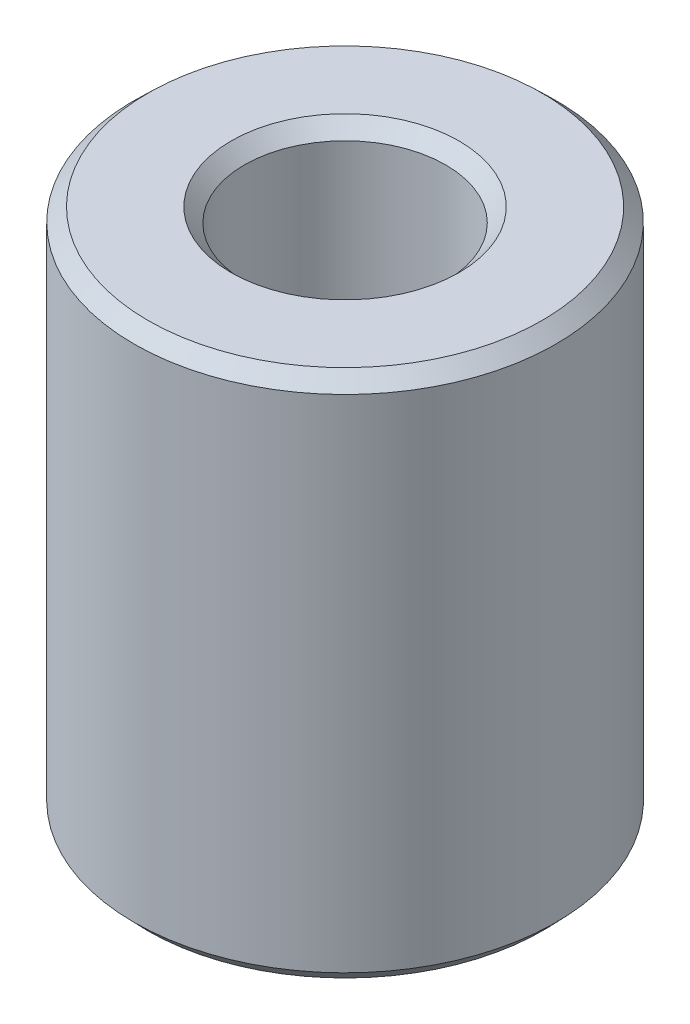
ISO-10303-21;
HEADER;
FILE_DESCRIPTION(('STEP AP214'),'2;1');
FILE_NAME('part.step','',(''),(''),'','','');
FILE_SCHEMA(('AUTOMOTIVE_DESIGN { 1 0 10303 214 1 1 1 1 }'));
ENDSEC;
DATA;
#1=APPLICATION_CONTEXT('core data for automotive mechanical design processes');
#2=APPLICATION_PROTOCOL_DEFINITION('international standard','automotive_design',2000,#1);
#3=PRODUCT_CONTEXT('',#1,'mechanical');
#4=PRODUCT('Part','Part','',(#3));
#5=PRODUCT_RELATED_PRODUCT_CATEGORY('part','',(#4));
#6=PRODUCT_DEFINITION_FORMATION('','',#4);
#7=PRODUCT_DEFINITION_CONTEXT('part definition',#1,'design');
#8=PRODUCT_DEFINITION('design','',#6,#7);
#9=PRODUCT_DEFINITION_SHAPE('','',#8);
#10=(LENGTH_UNIT() NAMED_UNIT(*) SI_UNIT(.MILLI.,.METRE.));
#11=(NAMED_UNIT(*) PLANE_ANGLE_UNIT() SI_UNIT($,.RADIAN.));
#12=(NAMED_UNIT(*) SI_UNIT($,.STERADIAN.) SOLID_ANGLE_UNIT());
#13=UNCERTAINTY_MEASURE_WITH_UNIT(LENGTH_MEASURE(1.E-05),#10,'distance_accuracy_value','');
#14=(GEOMETRIC_REPRESENTATION_CONTEXT(3) GLOBAL_UNCERTAINTY_ASSIGNED_CONTEXT((#13)) GLOBAL_UNIT_ASSIGNED_CONTEXT((#10,
#11,#12)) REPRESENTATION_CONTEXT('',''));
#15=CARTESIAN_POINT('',(0.,0.,0.));
#16=DIRECTION('',(0.,0.,1.));
#17=DIRECTION('',(1.,0.,0.));
#18=AXIS2_PLACEMENT_3D('',#15,#16,#17);
#19=CARTESIAN_POINT('',(0.,143.973495212151,0.));
#20=DIRECTION('',(0.,-1.,0.));
#21=DIRECTION('',(0.,0.,-1.));
#22=AXIS2_PLACEMENT_3D('',#19,#20,#21);
#23=CYLINDRICAL_SURFACE('',#22,57.5);
#24=CARTESIAN_POINT('',(0.,3.80443500115604,0.));
#25=DIRECTION('',(0.,1.,0.));
#26=DIRECTION('',(0.,0.,1.));
#27=AXIS2_PLACEMENT_3D('',#24,#25,#26);
#28=CIRCLE('',#27,57.5);
#29=CARTESIAN_POINT('',(0.,3.80443500115604,57.5));
#30=VERTEX_POINT('',#29);
#31=EDGE_CURVE('E10',#30,#30,#28,.T.);
#32=ORIENTED_EDGE('',*,*,#31,.T.);
#33=EDGE_LOOP('',(#32));
#34=FACE_BOUND('',#33,.T.);
#35=CARTESIAN_POINT('',(0.,140.314029289789,0.));
#36=DIRECTION('',(0.,1.,0.));
#37=DIRECTION('',(0.,0.,1.));
#38=AXIS2_PLACEMENT_3D('',#35,#36,#37);
#39=CIRCLE('',#38,57.5);
#40=CARTESIAN_POINT('',(0.,140.314029289789,57.5));
#41=VERTEX_POINT('',#40);
#42=EDGE_CURVE('E50',#41,#41,#39,.F.);
#43=ORIENTED_EDGE('',*,*,#42,.T.);
#44=EDGE_LOOP('',(#43));
#45=FACE_BOUND('',#44,.T.);
#46=ADVANCED_FACE('F39',(#34,#45),#23,.T.);
#47=CARTESIAN_POINT('',(0.,143.973495212151,0.));
#48=DIRECTION('',(0.,1.,0.));
#49=DIRECTION('',(0.,0.,1.));
#50=AXIS2_PLACEMENT_3D('',#47,#48,#49);
#51=PLANE('',#50);
#52=CARTESIAN_POINT('',(0.,143.973495212151,0.));
#53=DIRECTION('',(0.,1.,0.));
#54=DIRECTION('',(0.,0.,1.));
#55=AXIS2_PLACEMENT_3D('',#52,#53,#54);
#56=CIRCLE('',#55,31.0767008999664);
#57=CARTESIAN_POINT('',(0.,143.973495212151,31.0767008999664));
#58=VERTEX_POINT('',#57);
#59=EDGE_CURVE('E58',#58,#58,#56,.F.);
#60=ORIENTED_EDGE('',*,*,#59,.T.);
#61=EDGE_LOOP('',(#60));
#62=FACE_BOUND('',#61,.T.);
#63=CARTESIAN_POINT('',(0.,143.973495212151,0.));
#64=DIRECTION('',(0.,1.,0.));
#65=DIRECTION('',(0.,0.,1.));
#66=AXIS2_PLACEMENT_3D('',#63,#64,#65);
#67=CIRCLE('',#66,53.695564998844);
#68=CARTESIAN_POINT('',(0.,143.973495212151,53.695564998844));
#69=VERTEX_POINT('',#68);
#70=EDGE_CURVE('E61',#69,#69,#67,.T.);
#71=ORIENTED_EDGE('',*,*,#70,.T.);
#72=EDGE_LOOP('',(#71));
#73=FACE_BOUND('',#72,.T.);
#74=ADVANCED_FACE('F88',(#62,#73),#51,.T.);
#75=CARTESIAN_POINT('',(0.,0.,0.));
#76=DIRECTION('',(0.,1.,0.));
#77=DIRECTION('',(0.,0.,1.));
#78=AXIS2_PLACEMENT_3D('',#75,#76,#77);
#79=PLANE('',#78);
#80=CARTESIAN_POINT('',(0.,0.,0.));
#81=DIRECTION('',(0.,1.,0.));
#82=DIRECTION('',(0.,0.,1.));
#83=AXIS2_PLACEMENT_3D('',#80,#81,#82);
#84=CIRCLE('',#83,31.2216699787606);
#85=CARTESIAN_POINT('',(0.,0.,-31.2216699787606));
#86=VERTEX_POINT('',#85);
#87=EDGE_CURVE('E51',#86,#86,#84,.T.);
#88=ORIENTED_EDGE('',*,*,#87,.T.);
#89=EDGE_LOOP('',(#88));
#90=FACE_BOUND('',#89,.T.);
#91=CARTESIAN_POINT('',(0.,0.,0.));
#92=DIRECTION('',(0.,1.,0.));
#93=DIRECTION('',(0.,0.,1.));
#94=AXIS2_PLACEMENT_3D('',#91,#92,#93);
#95=CIRCLE('',#94,53.8405340776381);
#96=CARTESIAN_POINT('',(0.,0.,53.8405340776381));
#97=VERTEX_POINT('',#96);
#98=EDGE_CURVE('E54',#97,#97,#95,.F.);
#99=ORIENTED_EDGE('',*,*,#98,.T.);
#100=EDGE_LOOP('',(#99));
#101=FACE_BOUND('',#100,.T.);
#102=ADVANCED_FACE('F83',(#90,#101),#79,.F.);
#103=CARTESIAN_POINT('',(0.,143.973495212151,0.));
#104=DIRECTION('',(0.,-1.,0.));
#105=DIRECTION('',(0.,0.,-1.));
#106=AXIS2_PLACEMENT_3D('',#103,#104,#105);
#107=CYLINDRICAL_SURFACE('',#106,27.4172349776045);
#108=CARTESIAN_POINT('',(0.,140.169060210995,0.));
#109=DIRECTION('',(0.,1.,0.));
#110=DIRECTION('',(0.,0.,1.));
#111=AXIS2_PLACEMENT_3D('',#108,#109,#110);
#112=CIRCLE('',#111,27.4172349776045);
#113=CARTESIAN_POINT('',(0.,140.169060210995,27.4172349776045));
#114=VERTEX_POINT('',#113);
#115=EDGE_CURVE('E67',#114,#114,#112,.T.);
#116=ORIENTED_EDGE('',*,*,#115,.T.);
#117=EDGE_LOOP('',(#116));
#118=FACE_BOUND('',#117,.T.);
#119=CARTESIAN_POINT('',(0.,3.65946592236194,0.));
#120=DIRECTION('',(0.,1.,0.));
#121=DIRECTION('',(0.,0.,1.));
#122=AXIS2_PLACEMENT_3D('',#119,#120,#121);
#123=CIRCLE('',#122,27.4172349776045);
#124=CARTESIAN_POINT('',(0.,3.65946592236194,-27.4172349776045));
#125=VERTEX_POINT('',#124);
#126=EDGE_CURVE('E69',#125,#125,#123,.F.);
#127=ORIENTED_EDGE('',*,*,#126,.T.);
#128=EDGE_LOOP('',(#127));
#129=FACE_BOUND('',#128,.T.);
#130=ADVANCED_FACE('F71',(#118,#129),#107,.F.);
#131=CARTESIAN_POINT('',(0.,140.169060210995,0.));
#132=DIRECTION('',(0.,1.,0.));
#133=DIRECTION('',(0.,0.,1.));
#134=AXIS2_PLACEMENT_3D('',#131,#132,#133);
#135=CONICAL_SURFACE('',#134,27.4172349776045,0.765977909166865);
#136=ORIENTED_EDGE('',*,*,#59,.F.);
#137=EDGE_LOOP('',(#136));
#138=FACE_BOUND('',#137,.T.);
#139=ORIENTED_EDGE('',*,*,#115,.F.);
#140=EDGE_LOOP('',(#139));
#141=FACE_BOUND('',#140,.T.);
#142=ADVANCED_FACE('F77',(#138,#141),#135,.F.);
#143=CARTESIAN_POINT('',(0.,0.,0.));
#144=DIRECTION('',(0.,-1.,0.));
#145=DIRECTION('',(0.,0.,-1.));
#146=AXIS2_PLACEMENT_3D('',#143,#144,#145);
#147=CONICAL_SURFACE('',#146,31.2216699787606,0.804818417628025);
#148=CARTESIAN_POINT('',(0.,3.65946592236194,-27.4172349776045));
#149=CARTESIAN_POINT('',(0.,3.62134648567067,-27.4568645088665));
#150=CARTESIAN_POINT('',(0.,3.5832270489794,-27.4964940401286));
#151=CARTESIAN_POINT('',(0.,3.50698817559686,-27.5757531026527));
#152=CARTESIAN_POINT('',(0.,3.46886873890559,-27.6153826339147));
#153=CARTESIAN_POINT('',(0.,3.39262986552305,-27.6946416964388));
#154=CARTESIAN_POINT('',(0.,3.35451042883178,-27.7342712277008));
#155=CARTESIAN_POINT('',(0.,3.27827155544923,-27.8135302902249));
#156=CARTESIAN_POINT('',(0.,3.24015211875796,-27.853159821487));
#157=CARTESIAN_POINT('',(0.,3.16391324537542,-27.932418884011));
#158=CARTESIAN_POINT('',(0.,3.12579380868415,-27.9720484152731));
#159=CARTESIAN_POINT('',(0.,3.04955493530161,-28.0513074777972));
#160=CARTESIAN_POINT('',(0.,3.01143549861034,-28.0909370090592));
#161=CARTESIAN_POINT('',(0.,2.9351966252278,-28.1701960715833));
#162=CARTESIAN_POINT('',(0.,2.89707718853653,-28.2098256028453));
#163=CARTESIAN_POINT('',(0.,2.82083831515399,-28.2890846653694));
#164=CARTESIAN_POINT('',(0.,2.78271887846272,-28.3287141966315));
#165=CARTESIAN_POINT('',(0.,2.70648000508018,-28.4079732591556));
#166=CARTESIAN_POINT('',(0.,2.66836056838891,-28.4476027904176));
#167=CARTESIAN_POINT('',(0.,2.59212169500637,-28.5268618529417));
#168=CARTESIAN_POINT('',(0.,2.5540022583151,-28.5664913842037));
#169=CARTESIAN_POINT('',(0.,2.47776338493256,-28.6457504467278));
#170=CARTESIAN_POINT('',(0.,2.43964394824129,-28.6853799779898));
#171=CARTESIAN_POINT('',(0.,2.36340507485875,-28.7646390405139));
#172=CARTESIAN_POINT('',(0.,2.32528563816748,-28.804268571776));
#173=CARTESIAN_POINT('',(0.,2.24904676478494,-28.8835276343001));
#174=CARTESIAN_POINT('',(0.,2.21092732809367,-28.9231571655621));
#175=CARTESIAN_POINT('',(0.,2.13468845471113,-29.0024162280862));
#176=CARTESIAN_POINT('',(0.,2.09656901801986,-29.0420457593482));
#177=CARTESIAN_POINT('',(0.,2.02033014463732,-29.1213048218723));
#178=CARTESIAN_POINT('',(0.,1.98221070794605,-29.1609343531344));
#179=CARTESIAN_POINT('',(0.,1.90597183456351,-29.2401934156584));
#180=CARTESIAN_POINT('',(0.,1.86785239787224,-29.2798229469205));
#181=CARTESIAN_POINT('',(0.,1.7916135244897,-29.3590820094446));
#182=CARTESIAN_POINT('',(0.,1.75349408779843,-29.3987115407066));
#183=CARTESIAN_POINT('',(0.,1.67725521441589,-29.4779706032307));
#184=CARTESIAN_POINT('',(0.,1.63913577772462,-29.5176001344927));
#185=CARTESIAN_POINT('',(0.,1.56289690434208,-29.5968591970168));
#186=CARTESIAN_POINT('',(0.,1.52477746765081,-29.6364887282789));
#187=CARTESIAN_POINT('',(0.,1.44853859426827,-29.7157477908029));
#188=CARTESIAN_POINT('',(0.,1.410419157577,-29.755377322065));
#189=CARTESIAN_POINT('',(0.,1.33418028419446,-29.8346363845891));
#190=CARTESIAN_POINT('',(0.,1.29606084750319,-29.8742659158511));
#191=CARTESIAN_POINT('',(0.,1.21982197412065,-29.9535249783752));
#192=CARTESIAN_POINT('',(0.,1.18170253742938,-29.9931545096372));
#193=CARTESIAN_POINT('',(0.,1.10546366404684,-30.0724135721613));
#194=CARTESIAN_POINT('',(0.,1.06734422735556,-30.1120431034234));
#195=CARTESIAN_POINT('',(0.,0.991105353973024,-30.1913021659475));
#196=CARTESIAN_POINT('',(0.,0.952985917281755,-30.2309316972095));
#197=CARTESIAN_POINT('',(0.,0.876747043899214,-30.3101907597336));
#198=CARTESIAN_POINT('',(0.,0.838627607207944,-30.3498202909956));
#199=CARTESIAN_POINT('',(0.,0.762388733825403,-30.4290793535197));
#200=CARTESIAN_POINT('',(0.,0.724269297134134,-30.4687088847817));
#201=CARTESIAN_POINT('',(0.,0.648030423751593,-30.5479679473058));
#202=CARTESIAN_POINT('',(0.,0.609910987060323,-30.5875974785679));
#203=CARTESIAN_POINT('',(0.,0.533672113677782,-30.666856541092));
#204=CARTESIAN_POINT('',(0.,0.495552676986512,-30.706486072354));
#205=CARTESIAN_POINT('',(0.,0.419313803603972,-30.7857451348781));
#206=CARTESIAN_POINT('',(0.,0.381194366912702,-30.8253746661401));
#207=CARTESIAN_POINT('',(0.,0.304955493530162,-30.9046337286642));
#208=CARTESIAN_POINT('',(0.,0.266836056838891,-30.9442632599263));
#209=CARTESIAN_POINT('',(0.,0.190597183456351,-31.0235223224503));
#210=CARTESIAN_POINT('',(0.,0.152477746765081,-31.0631518537124));
#211=CARTESIAN_POINT('',(0.,0.076238873382541,-31.1424109162365));
#212=CARTESIAN_POINT('',(0.,0.0381194366912712,-31.1820404474985));
#213=CARTESIAN_POINT('',(0.,0.,-31.2216699787606));
#214=B_SPLINE_CURVE_WITH_KNOTS('',3,(#148,#149,#150,#151,#152,#153,#154,#155,#156,#157,#158,
#159,#160,#161,#162,#163,#164,#165,#166,#167,#168,#169,#170,#171,#172,#173,#174,#175,#176,#177,
#178,#179,#180,#181,#182,#183,#184,#185,#186,#187,#188,#189,#190,#191,#192,#193,#194,#195,#196,
#197,#198,#199,#200,#201,#202,#203,#204,#205,#206,#207,#208,#209,#210,#211,#212,#213),
.UNSPECIFIED.,.F.,.F.,(4,2,2,2,2,2,2,2,2,2,2,2,2,2,2,2,2,2,2,2,2,2,2,2,2,2,2,2,2,2,2,2,4),(0.,
0.164961573753951,0.329923147507904,0.494884721261855,0.659846295015806,0.824807868769759,
0.98976944252371,1.15473101627766,1.31969259003161,1.48465416378557,1.64961573753952,
1.81457731129347,1.97953888504742,2.14450045880137,2.30946203255533,2.47442360630928,
2.63938518006323,2.80434675381718,2.96930832757113,3.13426990132508,3.29923147507904,
3.46419304883299,3.62915462258694,3.79411619634089,3.95907777009484,4.12403934384879,
4.28900091760275,4.4539624913567,4.61892406511065,4.7838856388646,4.94884721261855,
5.11380878637251,5.27877036012646),.UNSPECIFIED.);
#215=EDGE_CURVE('BSEAM73',#125,#86,#214,.T.);
#216=ORIENTED_EDGE('',*,*,#126,.F.);
#217=ORIENTED_EDGE('',*,*,#87,.F.);
#218=ORIENTED_EDGE('',*,*,#215,.T.);
#219=ORIENTED_EDGE('',*,*,#215,.F.);
#220=EDGE_LOOP('',(#216,#218,#217,#219));
#221=FACE_BOUND('',#220,.T.);
#222=ADVANCED_FACE('F73',(#221),#147,.F.);
#223=CARTESIAN_POINT('',(0.,3.80443500115604,0.));
#224=DIRECTION('',(0.,1.,0.));
#225=DIRECTION('',(0.,0.,1.));
#226=AXIS2_PLACEMENT_3D('',#223,#224,#225);
#227=CONICAL_SURFACE('',#226,57.5,0.765977909166868);
#228=ORIENTED_EDGE('',*,*,#98,.F.);
#229=EDGE_LOOP('',(#228));
#230=FACE_BOUND('',#229,.T.);
#231=ORIENTED_EDGE('',*,*,#31,.F.);
#232=EDGE_LOOP('',(#231));
#233=FACE_BOUND('',#232,.T.);
#234=ADVANCED_FACE('F76',(#230,#233),#227,.T.);
#235=CARTESIAN_POINT('',(0.,143.973495212151,0.));
#236=DIRECTION('',(0.,-1.,0.));
#237=DIRECTION('',(0.,0.,-1.));
#238=AXIS2_PLACEMENT_3D('',#235,#236,#237);
#239=CONICAL_SURFACE('',#238,53.695564998844,0.804818417628031);
#240=ORIENTED_EDGE('',*,*,#42,.F.);
#241=EDGE_LOOP('',(#240));
#242=FACE_BOUND('',#241,.T.);
#243=ORIENTED_EDGE('',*,*,#70,.F.);
#244=EDGE_LOOP('',(#243));
#245=FACE_BOUND('',#244,.T.);
#246=ADVANCED_FACE('F45',(#242,#245),#239,.T.);
#247=CLOSED_SHELL('',(#46,#74,#102,#130,#142,#222,#234,#246));
#248=MANIFOLD_SOLID_BREP('B2',#247);
#249=ADVANCED_BREP_SHAPE_REPRESENTATION('',(#18,#248),#14);
#250=SHAPE_DEFINITION_REPRESENTATION(#9,#249);
ENDSEC;
END-ISO-10303-21;
